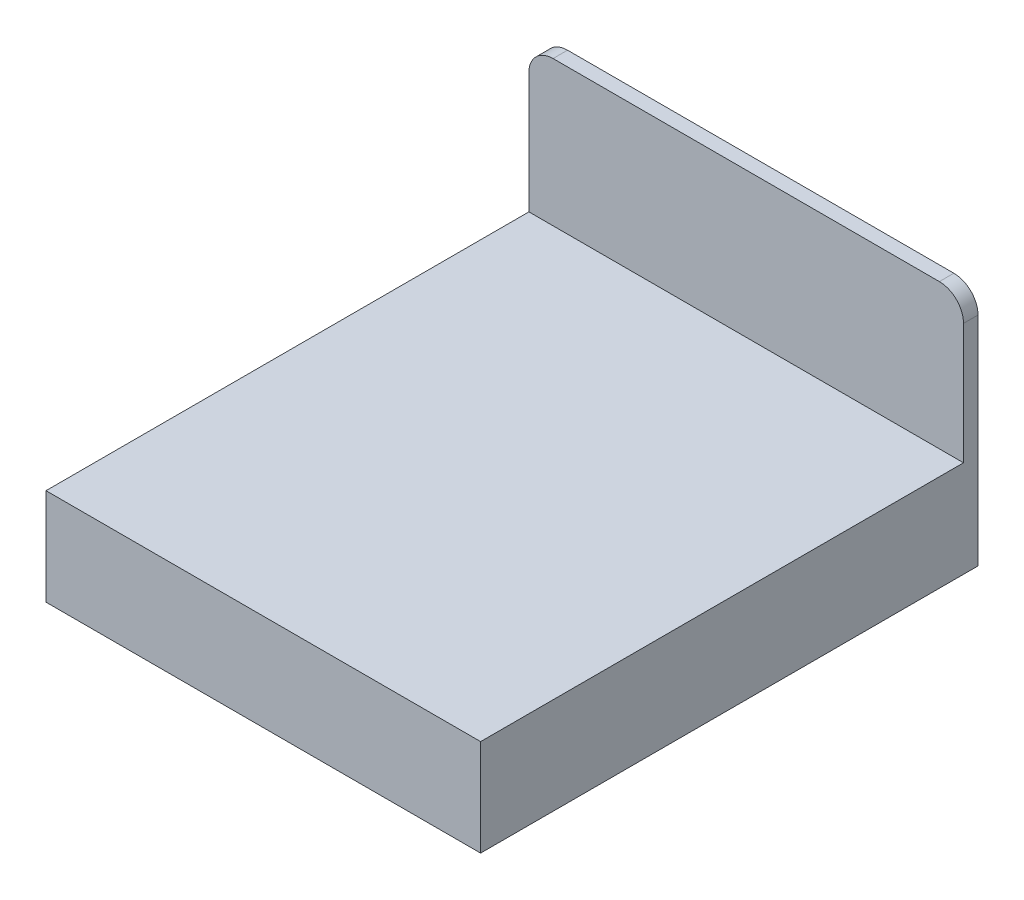
ISO-10303-21;
HEADER;
FILE_DESCRIPTION(('STEP AP214'),'2;1');
FILE_NAME('part.step','',(''),(''),'','','');
FILE_SCHEMA(('AUTOMOTIVE_DESIGN { 1 0 10303 214 1 1 1 1 }'));
ENDSEC;
DATA;
#1=APPLICATION_CONTEXT('core data for automotive mechanical design processes');
#2=APPLICATION_PROTOCOL_DEFINITION('international standard','automotive_design',2000,#1);
#3=PRODUCT_CONTEXT('',#1,'mechanical');
#4=PRODUCT('Part','Part','',(#3));
#5=PRODUCT_RELATED_PRODUCT_CATEGORY('part','',(#4));
#6=PRODUCT_DEFINITION_FORMATION('','',#4);
#7=PRODUCT_DEFINITION_CONTEXT('part definition',#1,'design');
#8=PRODUCT_DEFINITION('design','',#6,#7);
#9=PRODUCT_DEFINITION_SHAPE('','',#8);
#10=(LENGTH_UNIT() NAMED_UNIT(*) SI_UNIT(.MILLI.,.METRE.));
#11=(NAMED_UNIT(*) PLANE_ANGLE_UNIT() SI_UNIT($,.RADIAN.));
#12=(NAMED_UNIT(*) SI_UNIT($,.STERADIAN.) SOLID_ANGLE_UNIT());
#13=UNCERTAINTY_MEASURE_WITH_UNIT(LENGTH_MEASURE(1.E-05),#10,'distance_accuracy_value','');
#14=(GEOMETRIC_REPRESENTATION_CONTEXT(3) GLOBAL_UNCERTAINTY_ASSIGNED_CONTEXT((#13)) GLOBAL_UNIT_ASSIGNED_CONTEXT((#10,
#11,#12)) REPRESENTATION_CONTEXT('',''));
#15=CARTESIAN_POINT('',(0.,0.,0.));
#16=DIRECTION('',(0.,0.,1.));
#17=DIRECTION('',(1.,0.,0.));
#18=AXIS2_PLACEMENT_3D('',#15,#16,#17);
#19=CARTESIAN_POINT('',(0.,-400.,0.));
#20=DIRECTION('',(1.,0.,0.));
#21=DIRECTION('',(0.,0.,-1.));
#22=AXIS2_PLACEMENT_3D('',#19,#20,#21);
#23=PLANE('',#22);
#24=DIRECTION('',(0.,0.,-1.));
#25=VECTOR('',#24,1.);
#26=CARTESIAN_POINT('',(0.,0.,0.));
#27=LINE('',#26,#25);
#28=CARTESIAN_POINT('',(2.44929359829471E-13,0.,2000.));
#29=VERTEX_POINT('',#28);
#30=CARTESIAN_POINT('',(0.,0.,0.));
#31=VERTEX_POINT('',#30);
#32=EDGE_CURVE('E76',#29,#31,#27,.T.);
#33=ORIENTED_EDGE('',*,*,#32,.F.);
#34=DIRECTION('',(0.,1.,0.));
#35=VECTOR('',#34,1.);
#36=CARTESIAN_POINT('',(2.44929359829471E-13,-400.,2000.));
#37=LINE('',#36,#35);
#38=CARTESIAN_POINT('',(2.44929359829471E-13,-400.,2000.));
#39=VERTEX_POINT('',#38);
#40=EDGE_CURVE('E11',#39,#29,#37,.T.);
#41=ORIENTED_EDGE('',*,*,#40,.F.);
#42=DIRECTION('',(0.,0.,-1.));
#43=VECTOR('',#42,1.);
#44=CARTESIAN_POINT('',(0.,-400.,0.));
#45=LINE('',#44,#43);
#46=CARTESIAN_POINT('',(0.,-400.,-60.));
#47=VERTEX_POINT('',#46);
#48=EDGE_CURVE('E86',#39,#47,#45,.T.);
#49=ORIENTED_EDGE('',*,*,#48,.T.);
#50=DIRECTION('',(0.,-1.,0.));
#51=VECTOR('',#50,1.);
#52=CARTESIAN_POINT('',(0.,-400.,-60.));
#53=LINE('',#52,#51);
#54=CARTESIAN_POINT('',(0.,499.999999999999,-60.));
#55=VERTEX_POINT('',#54);
#56=EDGE_CURVE('E151',#55,#47,#53,.T.);
#57=ORIENTED_EDGE('',*,*,#56,.F.);
#58=DIRECTION('',(0.,0.,1.));
#59=VECTOR('',#58,1.);
#60=CARTESIAN_POINT('',(0.,499.999999999999,-60.));
#61=LINE('',#60,#59);
#62=CARTESIAN_POINT('',(0.,499.999999999999,0.));
#63=VERTEX_POINT('',#62);
#64=EDGE_CURVE('E162',#55,#63,#61,.T.);
#65=ORIENTED_EDGE('',*,*,#64,.T.);
#66=DIRECTION('',(0.,-1.,0.));
#67=VECTOR('',#66,1.);
#68=CARTESIAN_POINT('',(0.,-400.,0.));
#69=LINE('',#68,#67);
#70=EDGE_CURVE('E79',#63,#31,#69,.T.);
#71=ORIENTED_EDGE('',*,*,#70,.T.);
#72=EDGE_LOOP('',(#33,#41,#49,#57,#65,#71));
#73=FACE_BOUND('',#72,.T.);
#74=ADVANCED_FACE('F35',(#73),#23,.T.);
#75=CARTESIAN_POINT('',(2.44929359829471E-13,-400.,2000.));
#76=DIRECTION('',(0.,0.,1.));
#77=DIRECTION('',(1.,0.,0.));
#78=AXIS2_PLACEMENT_3D('',#75,#76,#77);
#79=PLANE('',#78);
#80=DIRECTION('',(1.,0.,0.));
#81=VECTOR('',#80,1.);
#82=CARTESIAN_POINT('',(2.44929359829471E-13,0.,2000.));
#83=LINE('',#82,#81);
#84=CARTESIAN_POINT('',(-1800.,0.,2000.));
#85=VERTEX_POINT('',#84);
#86=EDGE_CURVE('E71',#85,#29,#83,.T.);
#87=ORIENTED_EDGE('',*,*,#86,.F.);
#88=DIRECTION('',(0.,1.,0.));
#89=VECTOR('',#88,1.);
#90=CARTESIAN_POINT('',(-1800.,-400.,2000.));
#91=LINE('',#90,#89);
#92=CARTESIAN_POINT('',(-1800.,-400.,2000.));
#93=VERTEX_POINT('',#92);
#94=EDGE_CURVE('E44',#93,#85,#91,.T.);
#95=ORIENTED_EDGE('',*,*,#94,.F.);
#96=DIRECTION('',(1.,0.,0.));
#97=VECTOR('',#96,1.);
#98=CARTESIAN_POINT('',(2.44929359829471E-13,-400.,2000.));
#99=LINE('',#98,#97);
#100=EDGE_CURVE('E73',#93,#39,#99,.T.);
#101=ORIENTED_EDGE('',*,*,#100,.T.);
#102=ORIENTED_EDGE('',*,*,#40,.T.);
#103=EDGE_LOOP('',(#87,#95,#101,#102));
#104=FACE_BOUND('',#103,.T.);
#105=ADVANCED_FACE('F69',(#104),#79,.T.);
#106=CARTESIAN_POINT('',(-1800.,-400.,2.20436423846524E-13));
#107=DIRECTION('',(-1.,0.,0.));
#108=DIRECTION('',(0.,0.,1.));
#109=AXIS2_PLACEMENT_3D('',#106,#107,#108);
#110=PLANE('',#109);
#111=DIRECTION('',(0.,0.,1.));
#112=VECTOR('',#111,1.);
#113=CARTESIAN_POINT('',(-1800.,0.,2.20436423846524E-13));
#114=LINE('',#113,#112);
#115=CARTESIAN_POINT('',(-1800.,0.,2.20436423846524E-13));
#116=VERTEX_POINT('',#115);
#117=EDGE_CURVE('E85',#116,#85,#114,.T.);
#118=ORIENTED_EDGE('',*,*,#117,.F.);
#119=DIRECTION('',(0.,1.,0.));
#120=VECTOR('',#119,1.);
#121=CARTESIAN_POINT('',(-1800.,-400.,2.20436423846524E-13));
#122=LINE('',#121,#120);
#123=CARTESIAN_POINT('',(-1800.,499.999999999999,2.20436423846524E-13));
#124=VERTEX_POINT('',#123);
#125=EDGE_CURVE('E105',#116,#124,#122,.T.);
#126=ORIENTED_EDGE('',*,*,#125,.T.);
#127=DIRECTION('',(0.,0.,1.));
#128=VECTOR('',#127,1.);
#129=CARTESIAN_POINT('',(-1800.,499.999999999999,-59.9999999999998));
#130=LINE('',#129,#128);
#131=CARTESIAN_POINT('',(-1800.,499.999999999999,-59.9999999999998));
#132=VERTEX_POINT('',#131);
#133=EDGE_CURVE('E83',#132,#124,#130,.T.);
#134=ORIENTED_EDGE('',*,*,#133,.F.);
#135=DIRECTION('',(0.,1.,0.));
#136=VECTOR('',#135,1.);
#137=CARTESIAN_POINT('',(-1800.,-400.,-59.9999999999998));
#138=LINE('',#137,#136);
#139=CARTESIAN_POINT('',(-1800.,-400.,-59.9999999999998));
#140=VERTEX_POINT('',#139);
#141=EDGE_CURVE('E141',#140,#132,#138,.T.);
#142=ORIENTED_EDGE('',*,*,#141,.F.);
#143=DIRECTION('',(0.,0.,1.));
#144=VECTOR('',#143,1.);
#145=CARTESIAN_POINT('',(-1800.,-400.,2.20436423846524E-13));
#146=LINE('',#145,#144);
#147=EDGE_CURVE('E88',#140,#93,#146,.T.);
#148=ORIENTED_EDGE('',*,*,#147,.T.);
#149=ORIENTED_EDGE('',*,*,#94,.T.);
#150=EDGE_LOOP('',(#118,#126,#134,#142,#148,#149));
#151=FACE_BOUND('',#150,.T.);
#152=ADVANCED_FACE('F142',(#151),#110,.T.);
#153=CARTESIAN_POINT('',(0.,-400.,0.));
#154=DIRECTION('',(0.,-1.,0.));
#155=DIRECTION('',(0.,0.,-1.));
#156=AXIS2_PLACEMENT_3D('',#153,#154,#155);
#157=PLANE('',#156);
#158=ORIENTED_EDGE('',*,*,#48,.F.);
#159=ORIENTED_EDGE('',*,*,#100,.F.);
#160=ORIENTED_EDGE('',*,*,#147,.F.);
#161=DIRECTION('',(-1.,0.,0.));
#162=VECTOR('',#161,1.);
#163=CARTESIAN_POINT('',(-1800.,-400.,-59.9999999999998));
#164=LINE('',#163,#162);
#165=EDGE_CURVE('E138',#47,#140,#164,.T.);
#166=ORIENTED_EDGE('',*,*,#165,.F.);
#167=EDGE_LOOP('',(#158,#159,#160,#166));
#168=FACE_BOUND('',#167,.T.);
#169=ADVANCED_FACE('F136',(#168),#157,.T.);
#170=CARTESIAN_POINT('',(0.,0.,0.));
#171=DIRECTION('',(0.,-1.,0.));
#172=DIRECTION('',(0.,0.,-1.));
#173=AXIS2_PLACEMENT_3D('',#170,#171,#172);
#174=PLANE('',#173);
#175=ORIENTED_EDGE('',*,*,#32,.T.);
#176=DIRECTION('',(-1.,0.,0.));
#177=VECTOR('',#176,1.);
#178=CARTESIAN_POINT('',(0.,0.,0.));
#179=LINE('',#178,#177);
#180=EDGE_CURVE('E82',#31,#116,#179,.T.);
#181=ORIENTED_EDGE('',*,*,#180,.T.);
#182=ORIENTED_EDGE('',*,*,#117,.T.);
#183=ORIENTED_EDGE('',*,*,#86,.T.);
#184=EDGE_LOOP('',(#175,#181,#182,#183));
#185=FACE_BOUND('',#184,.T.);
#186=ADVANCED_FACE('F84',(#185),#174,.F.);
#187=CARTESIAN_POINT('',(-1700.,500.,-59.9999999999998));
#188=DIRECTION('',(0.,0.,1.));
#189=DIRECTION('',(1.,0.,0.));
#190=AXIS2_PLACEMENT_3D('',#187,#188,#189);
#191=CYLINDRICAL_SURFACE('',#190,100.);
#192=CARTESIAN_POINT('',(-1700.,500.,2.0818995585505E-13));
#193=DIRECTION('',(0.,0.,-1.));
#194=DIRECTION('',(-1.,0.,0.));
#195=AXIS2_PLACEMENT_3D('',#192,#193,#194);
#196=CIRCLE('',#195,100.);
#197=CARTESIAN_POINT('',(-1700.,600.,2.0818995585505E-13));
#198=VERTEX_POINT('',#197);
#199=EDGE_CURVE('E165',#124,#198,#196,.T.);
#200=ORIENTED_EDGE('',*,*,#199,.T.);
#201=DIRECTION('',(0.,0.,1.));
#202=VECTOR('',#201,1.);
#203=CARTESIAN_POINT('',(-1700.,600.,-59.9999999999998));
#204=LINE('',#203,#202);
#205=CARTESIAN_POINT('',(-1700.,600.,-59.9999999999998));
#206=VERTEX_POINT('',#205);
#207=EDGE_CURVE('E177',#206,#198,#204,.T.);
#208=ORIENTED_EDGE('',*,*,#207,.F.);
#209=CARTESIAN_POINT('',(-1700.,500.,-59.9999999999998));
#210=DIRECTION('',(0.,0.,-1.));
#211=DIRECTION('',(-1.,0.,0.));
#212=AXIS2_PLACEMENT_3D('',#209,#210,#211);
#213=CIRCLE('',#212,100.);
#214=EDGE_CURVE('E146',#132,#206,#213,.T.);
#215=ORIENTED_EDGE('',*,*,#214,.F.);
#216=ORIENTED_EDGE('',*,*,#133,.T.);
#217=EDGE_LOOP('',(#200,#208,#215,#216));
#218=FACE_BOUND('',#217,.T.);
#219=ADVANCED_FACE('F184',(#218),#191,.T.);
#220=CARTESIAN_POINT('',(-1700.,600.,-59.9999999999998));
#221=DIRECTION('',(0.,-1.,0.));
#222=DIRECTION('',(1.,0.,0.));
#223=AXIS2_PLACEMENT_3D('',#220,#221,#222);
#224=PLANE('',#223);
#225=DIRECTION('',(1.,0.,0.));
#226=VECTOR('',#225,1.);
#227=CARTESIAN_POINT('',(-1700.,600.,2.0818995585505E-13));
#228=LINE('',#227,#226);
#229=CARTESIAN_POINT('',(-100.000000000001,600.,0.));
#230=VERTEX_POINT('',#229);
#231=EDGE_CURVE('E185',#198,#230,#228,.T.);
#232=ORIENTED_EDGE('',*,*,#231,.T.);
#233=DIRECTION('',(0.,0.,1.));
#234=VECTOR('',#233,1.);
#235=CARTESIAN_POINT('',(-100.000000000001,600.,-60.));
#236=LINE('',#235,#234);
#237=CARTESIAN_POINT('',(-100.000000000001,600.,-60.));
#238=VERTEX_POINT('',#237);
#239=EDGE_CURVE('E175',#238,#230,#236,.T.);
#240=ORIENTED_EDGE('',*,*,#239,.F.);
#241=DIRECTION('',(1.,0.,0.));
#242=VECTOR('',#241,1.);
#243=CARTESIAN_POINT('',(-1700.,600.,-59.9999999999998));
#244=LINE('',#243,#242);
#245=EDGE_CURVE('E157',#206,#238,#244,.T.);
#246=ORIENTED_EDGE('',*,*,#245,.F.);
#247=ORIENTED_EDGE('',*,*,#207,.T.);
#248=EDGE_LOOP('',(#232,#240,#246,#247));
#249=FACE_BOUND('',#248,.T.);
#250=ADVANCED_FACE('F191',(#249),#224,.F.);
#251=CARTESIAN_POINT('',(-100.,500.,-60.));
#252=DIRECTION('',(0.,0.,1.));
#253=DIRECTION('',(1.,0.,0.));
#254=AXIS2_PLACEMENT_3D('',#251,#252,#253);
#255=CYLINDRICAL_SURFACE('',#254,100.);
#256=CARTESIAN_POINT('',(-100.,500.,0.));
#257=DIRECTION('',(0.,0.,-1.));
#258=DIRECTION('',(-1.,0.,0.));
#259=AXIS2_PLACEMENT_3D('',#256,#257,#258);
#260=CIRCLE('',#259,100.);
#261=EDGE_CURVE('E153',#230,#63,#260,.T.);
#262=ORIENTED_EDGE('',*,*,#261,.T.);
#263=ORIENTED_EDGE('',*,*,#64,.F.);
#264=CARTESIAN_POINT('',(-100.,500.,-60.));
#265=DIRECTION('',(0.,0.,-1.));
#266=DIRECTION('',(-1.,0.,0.));
#267=AXIS2_PLACEMENT_3D('',#264,#265,#266);
#268=CIRCLE('',#267,100.);
#269=EDGE_CURVE('E159',#238,#55,#268,.T.);
#270=ORIENTED_EDGE('',*,*,#269,.F.);
#271=ORIENTED_EDGE('',*,*,#239,.T.);
#272=EDGE_LOOP('',(#262,#263,#270,#271));
#273=FACE_BOUND('',#272,.T.);
#274=ADVANCED_FACE('F189',(#273),#255,.T.);
#275=CARTESIAN_POINT('',(-100.,500.,-60.));
#276=DIRECTION('',(0.,0.,-1.));
#277=DIRECTION('',(-1.,0.,0.));
#278=AXIS2_PLACEMENT_3D('',#275,#276,#277);
#279=PLANE('',#278);
#280=ORIENTED_EDGE('',*,*,#165,.T.);
#281=ORIENTED_EDGE('',*,*,#141,.T.);
#282=ORIENTED_EDGE('',*,*,#214,.T.);
#283=ORIENTED_EDGE('',*,*,#245,.T.);
#284=ORIENTED_EDGE('',*,*,#269,.T.);
#285=ORIENTED_EDGE('',*,*,#56,.T.);
#286=EDGE_LOOP('',(#280,#281,#282,#283,#284,#285));
#287=FACE_BOUND('',#286,.T.);
#288=ADVANCED_FACE('F149',(#287),#279,.T.);
#289=CARTESIAN_POINT('',(-100.,500.,0.));
#290=DIRECTION('',(0.,0.,-1.));
#291=DIRECTION('',(-1.,0.,0.));
#292=AXIS2_PLACEMENT_3D('',#289,#290,#291);
#293=PLANE('',#292);
#294=ORIENTED_EDGE('',*,*,#180,.F.);
#295=ORIENTED_EDGE('',*,*,#70,.F.);
#296=ORIENTED_EDGE('',*,*,#261,.F.);
#297=ORIENTED_EDGE('',*,*,#231,.F.);
#298=ORIENTED_EDGE('',*,*,#199,.F.);
#299=ORIENTED_EDGE('',*,*,#125,.F.);
#300=EDGE_LOOP('',(#294,#295,#296,#297,#298,#299));
#301=FACE_BOUND('',#300,.T.);
#302=ADVANCED_FACE('F100',(#301),#293,.F.);
#303=CLOSED_SHELL('',(#74,#105,#152,#169,#186,#219,#250,#274,#288,#302));
#304=MANIFOLD_SOLID_BREP('B2',#303);
#305=ADVANCED_BREP_SHAPE_REPRESENTATION('',(#18,#304),#14);
#306=SHAPE_DEFINITION_REPRESENTATION(#9,#305);
ENDSEC;
END-ISO-10303-21;
